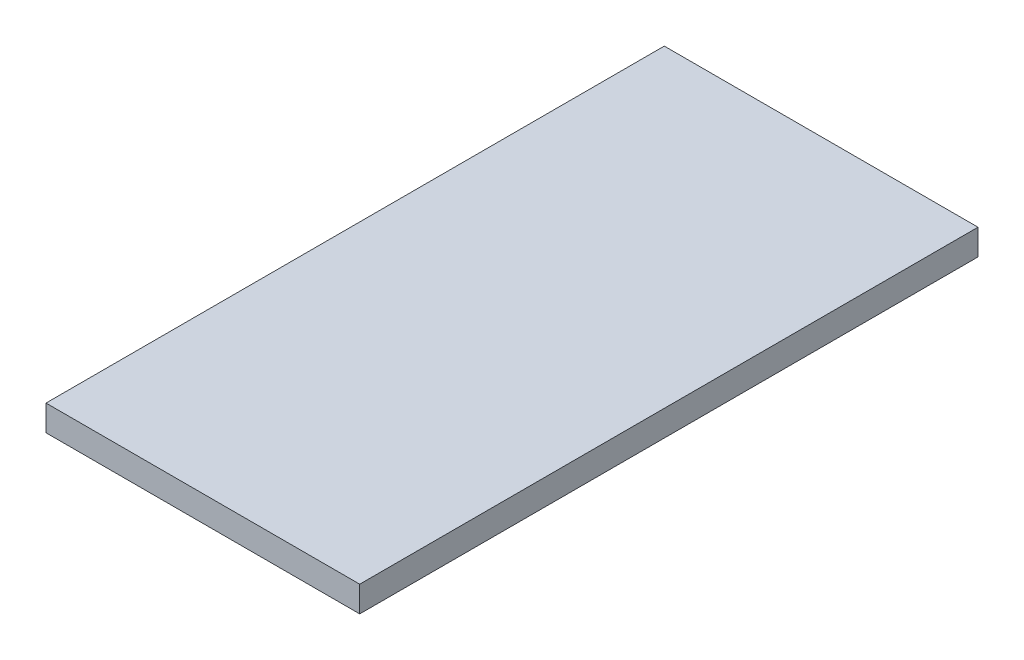
ISO-10303-21;
HEADER;
FILE_DESCRIPTION(('STEP AP214'),'2;1');
FILE_NAME('part.step','',(''),(''),'','','');
FILE_SCHEMA(('AUTOMOTIVE_DESIGN { 1 0 10303 214 1 1 1 1 }'));
ENDSEC;
DATA;
#1=APPLICATION_CONTEXT('core data for automotive mechanical design processes');
#2=APPLICATION_PROTOCOL_DEFINITION('international standard','automotive_design',2000,#1);
#3=PRODUCT_CONTEXT('',#1,'mechanical');
#4=PRODUCT('Part','Part','',(#3));
#5=PRODUCT_RELATED_PRODUCT_CATEGORY('part','',(#4));
#6=PRODUCT_DEFINITION_FORMATION('','',#4);
#7=PRODUCT_DEFINITION_CONTEXT('part definition',#1,'design');
#8=PRODUCT_DEFINITION('design','',#6,#7);
#9=PRODUCT_DEFINITION_SHAPE('','',#8);
#10=(LENGTH_UNIT() NAMED_UNIT(*) SI_UNIT(.MILLI.,.METRE.));
#11=(NAMED_UNIT(*) PLANE_ANGLE_UNIT() SI_UNIT($,.RADIAN.));
#12=(NAMED_UNIT(*) SI_UNIT($,.STERADIAN.) SOLID_ANGLE_UNIT());
#13=UNCERTAINTY_MEASURE_WITH_UNIT(LENGTH_MEASURE(1.E-05),#10,'distance_accuracy_value','');
#14=(GEOMETRIC_REPRESENTATION_CONTEXT(3) GLOBAL_UNCERTAINTY_ASSIGNED_CONTEXT((#13)) GLOBAL_UNIT_ASSIGNED_CONTEXT((#10,
#11,#12)) REPRESENTATION_CONTEXT('',''));
#15=CARTESIAN_POINT('',(0.,0.,0.));
#16=DIRECTION('',(0.,0.,1.));
#17=DIRECTION('',(1.,0.,0.));
#18=AXIS2_PLACEMENT_3D('',#15,#16,#17);
#19=CARTESIAN_POINT('',(86.875778701027,57.4,-304.8));
#20=DIRECTION('',(-1.,0.,0.));
#21=DIRECTION('',(0.,-1.,0.));
#22=AXIS2_PLACEMENT_3D('',#19,#20,#21);
#23=PLANE('',#22);
#24=DIRECTION('',(0.,-1.,0.));
#25=VECTOR('',#24,1.);
#26=CARTESIAN_POINT('',(86.875778701027,57.4,0.));
#27=LINE('',#26,#25);
#28=CARTESIAN_POINT('',(86.875778701027,57.4,0.));
#29=VERTEX_POINT('',#28);
#30=CARTESIAN_POINT('',(86.875778701027,44.7,0.));
#31=VERTEX_POINT('',#30);
#32=EDGE_CURVE('E99',#29,#31,#27,.T.);
#33=ORIENTED_EDGE('',*,*,#32,.T.);
#34=DIRECTION('',(0.,0.,1.));
#35=VECTOR('',#34,1.);
#36=CARTESIAN_POINT('',(86.875778701027,44.7,-304.8));
#37=LINE('',#36,#35);
#38=CARTESIAN_POINT('',(86.875778701027,44.7,-304.8));
#39=VERTEX_POINT('',#38);
#40=EDGE_CURVE('E11',#39,#31,#37,.T.);
#41=ORIENTED_EDGE('',*,*,#40,.F.);
#42=DIRECTION('',(0.,-1.,0.));
#43=VECTOR('',#42,1.);
#44=CARTESIAN_POINT('',(86.875778701027,57.4,-304.8));
#45=LINE('',#44,#43);
#46=CARTESIAN_POINT('',(86.875778701027,57.4,-304.8));
#47=VERTEX_POINT('',#46);
#48=EDGE_CURVE('E85',#47,#39,#45,.T.);
#49=ORIENTED_EDGE('',*,*,#48,.F.);
#50=DIRECTION('',(0.,0.,1.));
#51=VECTOR('',#50,1.);
#52=CARTESIAN_POINT('',(86.875778701027,57.4,-304.8));
#53=LINE('',#52,#51);
#54=EDGE_CURVE('E52',#47,#29,#53,.T.);
#55=ORIENTED_EDGE('',*,*,#54,.T.);
#56=EDGE_LOOP('',(#33,#41,#49,#55));
#57=FACE_BOUND('',#56,.T.);
#58=ADVANCED_FACE('F36',(#57),#23,.F.);
#59=CARTESIAN_POINT('',(86.875778701027,44.7,-304.8));
#60=DIRECTION('',(0.,1.,0.));
#61=DIRECTION('',(0.,0.,1.));
#62=AXIS2_PLACEMENT_3D('',#59,#60,#61);
#63=PLANE('',#62);
#64=DIRECTION('',(-1.,0.,0.));
#65=VECTOR('',#64,1.);
#66=CARTESIAN_POINT('',(86.875778701027,44.7,0.));
#67=LINE('',#66,#65);
#68=CARTESIAN_POINT('',(-67.7742212989729,44.7,0.));
#69=VERTEX_POINT('',#68);
#70=EDGE_CURVE('E90',#31,#69,#67,.T.);
#71=ORIENTED_EDGE('',*,*,#70,.T.);
#72=DIRECTION('',(0.,0.,1.));
#73=VECTOR('',#72,1.);
#74=CARTESIAN_POINT('',(-67.7742212989729,44.7,-304.8));
#75=LINE('',#74,#73);
#76=CARTESIAN_POINT('',(-67.7742212989729,44.7,-304.8));
#77=VERTEX_POINT('',#76);
#78=EDGE_CURVE('E44',#77,#69,#75,.T.);
#79=ORIENTED_EDGE('',*,*,#78,.F.);
#80=DIRECTION('',(-1.,0.,0.));
#81=VECTOR('',#80,1.);
#82=CARTESIAN_POINT('',(86.875778701027,44.7,-304.8));
#83=LINE('',#82,#81);
#84=EDGE_CURVE('E77',#39,#77,#83,.T.);
#85=ORIENTED_EDGE('',*,*,#84,.F.);
#86=ORIENTED_EDGE('',*,*,#40,.T.);
#87=EDGE_LOOP('',(#71,#79,#85,#86));
#88=FACE_BOUND('',#87,.T.);
#89=ADVANCED_FACE('F89',(#88),#63,.F.);
#90=CARTESIAN_POINT('',(-67.774221298973,57.4,-304.8));
#91=DIRECTION('',(-1.,0.,0.));
#92=DIRECTION('',(0.,-1.,0.));
#93=AXIS2_PLACEMENT_3D('',#90,#91,#92);
#94=PLANE('',#93);
#95=DIRECTION('',(0.,-1.,0.));
#96=VECTOR('',#95,1.);
#97=CARTESIAN_POINT('',(-67.774221298973,57.4,0.));
#98=LINE('',#97,#96);
#99=CARTESIAN_POINT('',(-67.774221298973,57.4,0.));
#100=VERTEX_POINT('',#99);
#101=EDGE_CURVE('E102',#100,#69,#98,.T.);
#102=ORIENTED_EDGE('',*,*,#101,.F.);
#103=DIRECTION('',(0.,0.,1.));
#104=VECTOR('',#103,1.);
#105=CARTESIAN_POINT('',(-67.774221298973,57.4,-304.8));
#106=LINE('',#105,#104);
#107=CARTESIAN_POINT('',(-67.774221298973,57.4,-304.8));
#108=VERTEX_POINT('',#107);
#109=EDGE_CURVE('E66',#108,#100,#106,.T.);
#110=ORIENTED_EDGE('',*,*,#109,.F.);
#111=DIRECTION('',(0.,-1.,0.));
#112=VECTOR('',#111,1.);
#113=CARTESIAN_POINT('',(-67.774221298973,57.4,-304.8));
#114=LINE('',#113,#112);
#115=EDGE_CURVE('E84',#108,#77,#114,.T.);
#116=ORIENTED_EDGE('',*,*,#115,.T.);
#117=ORIENTED_EDGE('',*,*,#78,.T.);
#118=EDGE_LOOP('',(#102,#110,#116,#117));
#119=FACE_BOUND('',#118,.T.);
#120=ADVANCED_FACE('F93',(#119),#94,.T.);
#121=CARTESIAN_POINT('',(86.875778701027,57.4,-304.8));
#122=DIRECTION('',(0.,1.,0.));
#123=DIRECTION('',(-1.,0.,0.));
#124=AXIS2_PLACEMENT_3D('',#121,#122,#123);
#125=PLANE('',#124);
#126=DIRECTION('',(-1.,0.,0.));
#127=VECTOR('',#126,1.);
#128=CARTESIAN_POINT('',(86.875778701027,57.4,0.));
#129=LINE('',#128,#127);
#130=EDGE_CURVE('E104',#29,#100,#129,.T.);
#131=ORIENTED_EDGE('',*,*,#130,.F.);
#132=ORIENTED_EDGE('',*,*,#54,.F.);
#133=DIRECTION('',(-1.,0.,0.));
#134=VECTOR('',#133,1.);
#135=CARTESIAN_POINT('',(86.875778701027,57.4,-304.8));
#136=LINE('',#135,#134);
#137=EDGE_CURVE('E94',#47,#108,#136,.T.);
#138=ORIENTED_EDGE('',*,*,#137,.T.);
#139=ORIENTED_EDGE('',*,*,#109,.T.);
#140=EDGE_LOOP('',(#131,#132,#138,#139));
#141=FACE_BOUND('',#140,.T.);
#142=ADVANCED_FACE('F110',(#141),#125,.T.);
#143=CARTESIAN_POINT('',(0.,0.,-304.8));
#144=DIRECTION('',(0.,0.,-1.));
#145=DIRECTION('',(-1.,0.,0.));
#146=AXIS2_PLACEMENT_3D('',#143,#144,#145);
#147=PLANE('',#146);
#148=ORIENTED_EDGE('',*,*,#48,.T.);
#149=ORIENTED_EDGE('',*,*,#84,.T.);
#150=ORIENTED_EDGE('',*,*,#115,.F.);
#151=ORIENTED_EDGE('',*,*,#137,.F.);
#152=EDGE_LOOP('',(#148,#149,#150,#151));
#153=FACE_BOUND('',#152,.T.);
#154=ADVANCED_FACE('F81',(#153),#147,.T.);
#155=CARTESIAN_POINT('',(0.,0.,0.));
#156=DIRECTION('',(0.,0.,-1.));
#157=DIRECTION('',(-1.,0.,0.));
#158=AXIS2_PLACEMENT_3D('',#155,#156,#157);
#159=PLANE('',#158);
#160=ORIENTED_EDGE('',*,*,#32,.F.);
#161=ORIENTED_EDGE('',*,*,#130,.T.);
#162=ORIENTED_EDGE('',*,*,#101,.T.);
#163=ORIENTED_EDGE('',*,*,#70,.F.);
#164=EDGE_LOOP('',(#160,#161,#162,#163));
#165=FACE_BOUND('',#164,.T.);
#166=ADVANCED_FACE('F109',(#165),#159,.F.);
#167=CLOSED_SHELL('',(#58,#89,#120,#142,#154,#166));
#168=MANIFOLD_SOLID_BREP('B2',#167);
#169=ADVANCED_BREP_SHAPE_REPRESENTATION('',(#18,#168),#14);
#170=SHAPE_DEFINITION_REPRESENTATION(#9,#169);
ENDSEC;
END-ISO-10303-21;
